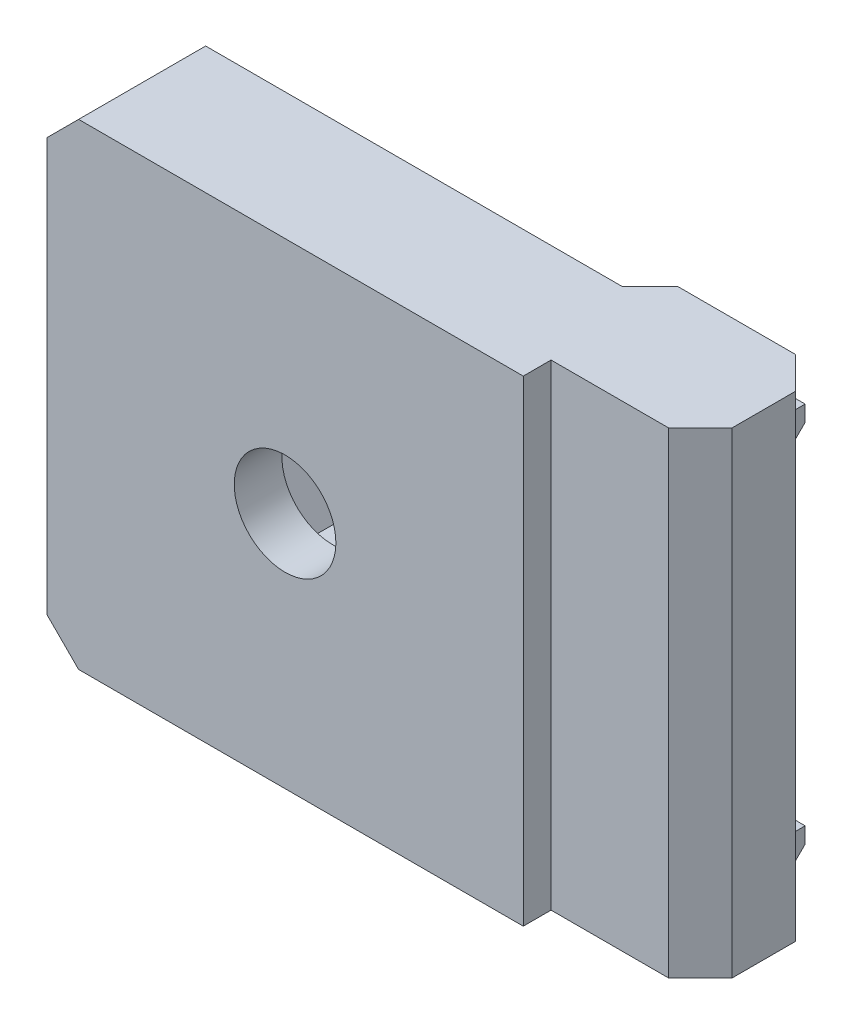
ISO-10303-21;
HEADER;
FILE_DESCRIPTION(('STEP AP214'),'2;1');
FILE_NAME('part.step','',(''),(''),'','','');
FILE_SCHEMA(('AUTOMOTIVE_DESIGN { 1 0 10303 214 1 1 1 1 }'));
ENDSEC;
DATA;
#1=APPLICATION_CONTEXT('core data for automotive mechanical design processes');
#2=APPLICATION_PROTOCOL_DEFINITION('international standard','automotive_design',2000,#1);
#3=PRODUCT_CONTEXT('',#1,'mechanical');
#4=PRODUCT('Part','Part','',(#3));
#5=PRODUCT_RELATED_PRODUCT_CATEGORY('part','',(#4));
#6=PRODUCT_DEFINITION_FORMATION('','',#4);
#7=PRODUCT_DEFINITION_CONTEXT('part definition',#1,'design');
#8=PRODUCT_DEFINITION('design','',#6,#7);
#9=PRODUCT_DEFINITION_SHAPE('','',#8);
#10=(LENGTH_UNIT() NAMED_UNIT(*) SI_UNIT(.MILLI.,.METRE.));
#11=(NAMED_UNIT(*) PLANE_ANGLE_UNIT() SI_UNIT($,.RADIAN.));
#12=(NAMED_UNIT(*) SI_UNIT($,.STERADIAN.) SOLID_ANGLE_UNIT());
#13=UNCERTAINTY_MEASURE_WITH_UNIT(LENGTH_MEASURE(1.E-05),#10,'distance_accuracy_value','');
#14=(GEOMETRIC_REPRESENTATION_CONTEXT(3) GLOBAL_UNCERTAINTY_ASSIGNED_CONTEXT((#13)) GLOBAL_UNIT_ASSIGNED_CONTEXT((#10,
#11,#12)) REPRESENTATION_CONTEXT('',''));
#15=CARTESIAN_POINT('',(0.,0.,0.));
#16=DIRECTION('',(0.,0.,1.));
#17=DIRECTION('',(1.,0.,0.));
#18=AXIS2_PLACEMENT_3D('',#15,#16,#17);
#19=CARTESIAN_POINT('',(0.,15.,-9.75));
#20=DIRECTION('',(0.,0.,1.));
#21=DIRECTION('',(1.,0.,0.));
#22=AXIS2_PLACEMENT_3D('',#19,#20,#21);
#23=PLANE('',#22);
#24=DIRECTION('',(-1.,0.,0.));
#25=VECTOR('',#24,1.);
#26=CARTESIAN_POINT('',(7.4,-12.6,-9.75));
#27=LINE('',#26,#25);
#28=CARTESIAN_POINT('',(7.4,-12.6,-9.75));
#29=VERTEX_POINT('',#28);
#30=CARTESIAN_POINT('',(0.,-12.6,-9.75));
#31=VERTEX_POINT('',#30);
#32=EDGE_CURVE('E224',#29,#31,#27,.T.);
#33=ORIENTED_EDGE('',*,*,#32,.F.);
#34=DIRECTION('',(0.,-1.,0.));
#35=VECTOR('',#34,1.);
#36=CARTESIAN_POINT('',(7.4,15.,-9.75));
#37=LINE('',#36,#35);
#38=CARTESIAN_POINT('',(7.4,-15.,-9.75));
#39=VERTEX_POINT('',#38);
#40=EDGE_CURVE('E210',#29,#39,#37,.T.);
#41=ORIENTED_EDGE('',*,*,#40,.T.);
#42=DIRECTION('',(-1.,0.,0.));
#43=VECTOR('',#42,1.);
#44=CARTESIAN_POINT('',(0.,-15.,-9.75));
#45=LINE('',#44,#43);
#46=CARTESIAN_POINT('',(0.,-15.,-9.75));
#47=VERTEX_POINT('',#46);
#48=EDGE_CURVE('E353',#39,#47,#45,.T.);
#49=ORIENTED_EDGE('',*,*,#48,.T.);
#50=DIRECTION('',(0.,-1.,0.));
#51=VECTOR('',#50,1.);
#52=CARTESIAN_POINT('',(0.,15.,-9.75));
#53=LINE('',#52,#51);
#54=EDGE_CURVE('E51',#31,#47,#53,.T.);
#55=ORIENTED_EDGE('',*,*,#54,.F.);
#56=EDGE_LOOP('',(#33,#41,#49,#55));
#57=FACE_BOUND('',#56,.T.);
#58=ADVANCED_FACE('F35',(#57),#23,.F.);
#59=DIRECTION('',(-1.,0.,0.));
#60=VECTOR('',#59,1.);
#61=CARTESIAN_POINT('',(7.4,-11.,-9.75));
#62=LINE('',#61,#60);
#63=CARTESIAN_POINT('',(7.4,-11.,-9.75));
#64=VERTEX_POINT('',#63);
#65=CARTESIAN_POINT('',(0.,-11.,-9.75));
#66=VERTEX_POINT('',#65);
#67=EDGE_CURVE('E59',#64,#66,#62,.T.);
#68=ORIENTED_EDGE('',*,*,#67,.T.);
#69=CARTESIAN_POINT('',(0.,10.4,-9.75));
#70=VERTEX_POINT('',#69);
#71=EDGE_CURVE('E376',#70,#66,#53,.T.);
#72=ORIENTED_EDGE('',*,*,#71,.F.);
#73=DIRECTION('',(-1.,0.,0.));
#74=VECTOR('',#73,1.);
#75=CARTESIAN_POINT('',(7.4,10.4,-9.75));
#76=LINE('',#75,#74);
#77=CARTESIAN_POINT('',(7.4,10.4,-9.75));
#78=VERTEX_POINT('',#77);
#79=EDGE_CURVE('E287',#78,#70,#76,.T.);
#80=ORIENTED_EDGE('',*,*,#79,.F.);
#81=EDGE_CURVE('E219',#78,#64,#37,.T.);
#82=ORIENTED_EDGE('',*,*,#81,.T.);
#83=EDGE_LOOP('',(#68,#72,#80,#82));
#84=FACE_BOUND('',#83,.T.);
#85=ADVANCED_FACE('F494',(#84),#23,.F.);
#86=CARTESIAN_POINT('',(0.,15.,-1.75));
#87=DIRECTION('',(-1.,0.,0.));
#88=DIRECTION('',(0.,0.,1.));
#89=AXIS2_PLACEMENT_3D('',#86,#87,#88);
#90=PLANE('',#89);
#91=DIRECTION('',(0.,0.,-1.));
#92=VECTOR('',#91,1.);
#93=CARTESIAN_POINT('',(0.,-15.,-1.75));
#94=LINE('',#93,#92);
#95=CARTESIAN_POINT('',(0.,-15.,0.));
#96=VERTEX_POINT('',#95);
#97=CARTESIAN_POINT('',(0.,-15.,-1.75));
#98=VERTEX_POINT('',#97);
#99=EDGE_CURVE('E324',#96,#98,#94,.T.);
#100=ORIENTED_EDGE('',*,*,#99,.T.);
#101=DIRECTION('',(0.,-1.,0.));
#102=VECTOR('',#101,1.);
#103=CARTESIAN_POINT('',(0.,15.,-1.75));
#104=LINE('',#103,#102);
#105=CARTESIAN_POINT('',(0.,15.,-1.75));
#106=VERTEX_POINT('',#105);
#107=EDGE_CURVE('E375',#106,#98,#104,.T.);
#108=ORIENTED_EDGE('',*,*,#107,.F.);
#109=DIRECTION('',(0.,0.,-1.));
#110=VECTOR('',#109,1.);
#111=CARTESIAN_POINT('',(0.,15.,-1.75));
#112=LINE('',#111,#110);
#113=CARTESIAN_POINT('',(0.,15.,0.));
#114=VERTEX_POINT('',#113);
#115=EDGE_CURVE('E325',#114,#106,#112,.T.);
#116=ORIENTED_EDGE('',*,*,#115,.F.);
#117=DIRECTION('',(0.,-1.,0.));
#118=VECTOR('',#117,1.);
#119=CARTESIAN_POINT('',(0.,15.,0.));
#120=LINE('',#119,#118);
#121=EDGE_CURVE('E344',#114,#96,#120,.T.);
#122=ORIENTED_EDGE('',*,*,#121,.T.);
#123=EDGE_LOOP('',(#100,#108,#116,#122));
#124=FACE_BOUND('',#123,.T.);
#125=ADVANCED_FACE('F458',(#124),#90,.F.);
#126=CARTESIAN_POINT('',(9.4,15.,-1.75));
#127=DIRECTION('',(0.,0.,-1.));
#128=DIRECTION('',(-1.,0.,0.));
#129=AXIS2_PLACEMENT_3D('',#126,#127,#128);
#130=PLANE('',#129);
#131=DIRECTION('',(1.,0.,0.));
#132=VECTOR('',#131,1.);
#133=CARTESIAN_POINT('',(9.4,-15.,-1.75));
#134=LINE('',#133,#132);
#135=CARTESIAN_POINT('',(7.39999999999999,-15.,-1.75));
#136=VERTEX_POINT('',#135);
#137=EDGE_CURVE('E347',#98,#136,#134,.T.);
#138=ORIENTED_EDGE('',*,*,#137,.T.);
#139=DIRECTION('',(0.,1.,0.));
#140=VECTOR('',#139,1.);
#141=CARTESIAN_POINT('',(7.39999999999999,15.,-1.75));
#142=LINE('',#141,#140);
#143=CARTESIAN_POINT('',(7.39999999999999,15.,-1.75));
#144=VERTEX_POINT('',#143);
#145=EDGE_CURVE('E409',#136,#144,#142,.T.);
#146=ORIENTED_EDGE('',*,*,#145,.T.);
#147=DIRECTION('',(1.,0.,0.));
#148=VECTOR('',#147,1.);
#149=CARTESIAN_POINT('',(9.4,15.,-1.75));
#150=LINE('',#149,#148);
#151=EDGE_CURVE('E328',#106,#144,#150,.T.);
#152=ORIENTED_EDGE('',*,*,#151,.F.);
#153=ORIENTED_EDGE('',*,*,#107,.T.);
#154=EDGE_LOOP('',(#138,#146,#152,#153));
#155=FACE_BOUND('',#154,.T.);
#156=ADVANCED_FACE('F508',(#155),#130,.F.);
#157=CARTESIAN_POINT('',(9.4,15.,-9.75));
#158=DIRECTION('',(-1.,0.,0.));
#159=DIRECTION('',(0.,0.,1.));
#160=AXIS2_PLACEMENT_3D('',#157,#158,#159);
#161=PLANE('',#160);
#162=DIRECTION('',(0.,0.,-1.));
#163=VECTOR('',#162,1.);
#164=CARTESIAN_POINT('',(9.4,15.,-9.75));
#165=LINE('',#164,#163);
#166=CARTESIAN_POINT('',(9.4,15.,-3.75000000000001));
#167=VERTEX_POINT('',#166);
#168=CARTESIAN_POINT('',(9.4,15.,-7.74999999999999));
#169=VERTEX_POINT('',#168);
#170=EDGE_CURVE('E332',#167,#169,#165,.T.);
#171=ORIENTED_EDGE('',*,*,#170,.F.);
#172=DIRECTION('',(0.,-1.,0.));
#173=VECTOR('',#172,1.);
#174=CARTESIAN_POINT('',(9.4,15.,-3.75000000000001));
#175=LINE('',#174,#173);
#176=CARTESIAN_POINT('',(9.4,-15.,-3.75000000000001));
#177=VERTEX_POINT('',#176);
#178=EDGE_CURVE('E401',#167,#177,#175,.T.);
#179=ORIENTED_EDGE('',*,*,#178,.T.);
#180=DIRECTION('',(0.,0.,-1.));
#181=VECTOR('',#180,1.);
#182=CARTESIAN_POINT('',(9.4,-15.,-9.75));
#183=LINE('',#182,#181);
#184=CARTESIAN_POINT('',(9.4,-15.,-7.74999999999999));
#185=VERTEX_POINT('',#184);
#186=EDGE_CURVE('E350',#177,#185,#183,.T.);
#187=ORIENTED_EDGE('',*,*,#186,.T.);
#188=DIRECTION('',(0.,1.,0.));
#189=VECTOR('',#188,1.);
#190=CARTESIAN_POINT('',(9.4,15.,-7.74999999999999));
#191=LINE('',#190,#189);
#192=EDGE_CURVE('E399',#185,#169,#191,.T.);
#193=ORIENTED_EDGE('',*,*,#192,.T.);
#194=EDGE_LOOP('',(#171,#179,#187,#193));
#195=FACE_BOUND('',#194,.T.);
#196=ADVANCED_FACE('F468',(#195),#161,.F.);
#197=CARTESIAN_POINT('',(7.4,15.,-9.75));
#198=VERTEX_POINT('',#197);
#199=CARTESIAN_POINT('',(7.4,12.,-9.75));
#200=VERTEX_POINT('',#199);
#201=EDGE_CURVE('E222',#198,#200,#37,.T.);
#202=ORIENTED_EDGE('',*,*,#201,.T.);
#203=DIRECTION('',(-1.,0.,0.));
#204=VECTOR('',#203,1.);
#205=CARTESIAN_POINT('',(7.4,12.,-9.75));
#206=LINE('',#205,#204);
#207=CARTESIAN_POINT('',(0.,12.,-9.75));
#208=VERTEX_POINT('',#207);
#209=EDGE_CURVE('E270',#200,#208,#206,.T.);
#210=ORIENTED_EDGE('',*,*,#209,.T.);
#211=CARTESIAN_POINT('',(0.,15.,-9.75));
#212=VERTEX_POINT('',#211);
#213=EDGE_CURVE('E372',#212,#208,#53,.T.);
#214=ORIENTED_EDGE('',*,*,#213,.F.);
#215=DIRECTION('',(-1.,0.,0.));
#216=VECTOR('',#215,1.);
#217=CARTESIAN_POINT('',(0.,15.,-9.75));
#218=LINE('',#217,#216);
#219=EDGE_CURVE('E335',#198,#212,#218,.T.);
#220=ORIENTED_EDGE('',*,*,#219,.F.);
#221=EDGE_LOOP('',(#202,#210,#214,#220));
#222=FACE_BOUND('',#221,.T.);
#223=ADVANCED_FACE('F496',(#222),#23,.F.);
#224=CARTESIAN_POINT('',(-1.75,15.,-8.));
#225=DIRECTION('',(0.707106781186549,0.,0.707106781186546));
#226=DIRECTION('',(0.707106781186546,0.,-0.707106781186549));
#227=AXIS2_PLACEMENT_3D('',#224,#225,#226);
#228=PLANE('',#227);
#229=DIRECTION('',(-0.707106781186546,0.,0.707106781186549));
#230=VECTOR('',#229,1.);
#231=CARTESIAN_POINT('',(-1.75,-15.,-8.));
#232=LINE('',#231,#230);
#233=CARTESIAN_POINT('',(-1.75,-15.,-8.));
#234=VERTEX_POINT('',#233);
#235=EDGE_CURVE('E355',#47,#234,#232,.T.);
#236=ORIENTED_EDGE('',*,*,#235,.T.);
#237=DIRECTION('',(0.,-1.,0.));
#238=VECTOR('',#237,1.);
#239=CARTESIAN_POINT('',(-1.75,15.,-8.));
#240=LINE('',#239,#238);
#241=CARTESIAN_POINT('',(-1.75,15.,-8.));
#242=VERTEX_POINT('',#241);
#243=EDGE_CURVE('E369',#242,#234,#240,.T.);
#244=ORIENTED_EDGE('',*,*,#243,.F.);
#245=DIRECTION('',(-0.707106781186546,0.,0.707106781186549));
#246=VECTOR('',#245,1.);
#247=CARTESIAN_POINT('',(-1.75,15.,-8.));
#248=LINE('',#247,#246);
#249=EDGE_CURVE('E337',#212,#242,#248,.T.);
#250=ORIENTED_EDGE('',*,*,#249,.F.);
#251=ORIENTED_EDGE('',*,*,#213,.T.);
#252=DIRECTION('',(0.,-1.,0.));
#253=VECTOR('',#252,1.);
#254=CARTESIAN_POINT('',(0.,10.4,-9.75));
#255=LINE('',#254,#253);
#256=EDGE_CURVE('E227',#208,#70,#255,.T.);
#257=ORIENTED_EDGE('',*,*,#256,.T.);
#258=ORIENTED_EDGE('',*,*,#71,.T.);
#259=DIRECTION('',(0.,-1.,0.));
#260=VECTOR('',#259,1.);
#261=CARTESIAN_POINT('',(0.,-12.6,-9.75));
#262=LINE('',#261,#260);
#263=EDGE_CURVE('E250',#66,#31,#262,.T.);
#264=ORIENTED_EDGE('',*,*,#263,.T.);
#265=ORIENTED_EDGE('',*,*,#54,.T.);
#266=EDGE_LOOP('',(#236,#244,#250,#251,#257,#258,#264,#265));
#267=FACE_BOUND('',#266,.T.);
#268=ADVANCED_FACE('F471',(#267),#228,.F.);
#269=CARTESIAN_POINT('',(-30.,15.,-8.));
#270=DIRECTION('',(0.,0.,1.));
#271=DIRECTION('',(1.,0.,0.));
#272=AXIS2_PLACEMENT_3D('',#269,#270,#271);
#273=PLANE('',#272);
#274=DIRECTION('',(1.,0.,0.));
#275=VECTOR('',#274,1.);
#276=CARTESIAN_POINT('',(-30.,-5.,-8.));
#277=LINE('',#276,#275);
#278=CARTESIAN_POINT('',(-17.8867513459481,-5.,-8.));
#279=VERTEX_POINT('',#278);
#280=CARTESIAN_POINT('',(-12.1132486540519,-5.00000000000001,-8.));
#281=VERTEX_POINT('',#280);
#282=EDGE_CURVE('E393',#279,#281,#277,.T.);
#283=ORIENTED_EDGE('',*,*,#282,.T.);
#284=DIRECTION('',(0.5,0.866025403784439,0.));
#285=VECTOR('',#284,1.);
#286=CARTESIAN_POINT('',(-7.92468245269451,2.25480947161672,-8.));
#287=LINE('',#286,#285);
#288=CARTESIAN_POINT('',(-9.22649730810374,0.,-8.));
#289=VERTEX_POINT('',#288);
#290=EDGE_CURVE('E396',#281,#289,#287,.T.);
#291=ORIENTED_EDGE('',*,*,#290,.T.);
#292=DIRECTION('',(-0.5,0.866025403784439,0.));
#293=VECTOR('',#292,1.);
#294=CARTESIAN_POINT('',(-20.9150635094611,20.2451905283833,-8.));
#295=LINE('',#294,#293);
#296=CARTESIAN_POINT('',(-12.1132486540519,5.,-8.));
#297=VERTEX_POINT('',#296);
#298=EDGE_CURVE('E379',#289,#297,#295,.T.);
#299=ORIENTED_EDGE('',*,*,#298,.T.);
#300=DIRECTION('',(-1.,0.,0.));
#301=VECTOR('',#300,1.);
#302=CARTESIAN_POINT('',(-30.,5.,-8.));
#303=LINE('',#302,#301);
#304=CARTESIAN_POINT('',(-17.8867513459481,5.,-8.));
#305=VERTEX_POINT('',#304);
#306=EDGE_CURVE('E384',#297,#305,#303,.T.);
#307=ORIENTED_EDGE('',*,*,#306,.T.);
#308=DIRECTION('',(-0.5,-0.866025403784439,0.));
#309=VECTOR('',#308,1.);
#310=CARTESIAN_POINT('',(-16.5849364905389,7.25480947161671,-8.));
#311=LINE('',#310,#309);
#312=CARTESIAN_POINT('',(-20.7735026918963,0.,-8.));
#313=VERTEX_POINT('',#312);
#314=EDGE_CURVE('E387',#305,#313,#311,.T.);
#315=ORIENTED_EDGE('',*,*,#314,.T.);
#316=DIRECTION('',(0.5,-0.866025403784439,0.));
#317=VECTOR('',#316,1.);
#318=CARTESIAN_POINT('',(-29.5753175473055,15.2451905283833,-8.));
#319=LINE('',#318,#317);
#320=EDGE_CURVE('E390',#313,#279,#319,.T.);
#321=ORIENTED_EDGE('',*,*,#320,.T.);
#322=EDGE_LOOP('',(#283,#291,#299,#307,#315,#321));
#323=FACE_BOUND('',#322,.T.);
#324=DIRECTION('',(-1.,0.,0.));
#325=VECTOR('',#324,1.);
#326=CARTESIAN_POINT('',(-30.,-15.,-8.));
#327=LINE('',#326,#325);
#328=CARTESIAN_POINT('',(-28.,-15.,-8.));
#329=VERTEX_POINT('',#328);
#330=EDGE_CURVE('E357',#234,#329,#327,.T.);
#331=ORIENTED_EDGE('',*,*,#330,.T.);
#332=DIRECTION('',(-0.707106781186548,0.707106781186548,0.));
#333=VECTOR('',#332,1.);
#334=CARTESIAN_POINT('',(-30.,-13.,-8.));
#335=LINE('',#334,#333);
#336=CARTESIAN_POINT('',(-30.,-13.,-8.));
#337=VERTEX_POINT('',#336);
#338=EDGE_CURVE('E11',#329,#337,#335,.T.);
#339=ORIENTED_EDGE('',*,*,#338,.T.);
#340=DIRECTION('',(0.,-1.,0.));
#341=VECTOR('',#340,1.);
#342=CARTESIAN_POINT('',(-30.,15.,-8.));
#343=LINE('',#342,#341);
#344=CARTESIAN_POINT('',(-30.,13.,-8.));
#345=VERTEX_POINT('',#344);
#346=EDGE_CURVE('E366',#345,#337,#343,.T.);
#347=ORIENTED_EDGE('',*,*,#346,.F.);
#348=DIRECTION('',(-0.707106781186548,-0.707106781186548,0.));
#349=VECTOR('',#348,1.);
#350=CARTESIAN_POINT('',(-28.,15.,-8.));
#351=LINE('',#350,#349);
#352=CARTESIAN_POINT('',(-28.,15.,-8.));
#353=VERTEX_POINT('',#352);
#354=EDGE_CURVE('E44',#345,#353,#351,.F.);
#355=ORIENTED_EDGE('',*,*,#354,.T.);
#356=DIRECTION('',(-1.,0.,0.));
#357=VECTOR('',#356,1.);
#358=CARTESIAN_POINT('',(-30.,15.,-8.));
#359=LINE('',#358,#357);
#360=EDGE_CURVE('E339',#242,#353,#359,.T.);
#361=ORIENTED_EDGE('',*,*,#360,.F.);
#362=ORIENTED_EDGE('',*,*,#243,.T.);
#363=EDGE_LOOP('',(#331,#339,#347,#355,#361,#362));
#364=FACE_BOUND('',#363,.T.);
#365=ADVANCED_FACE('F430',(#323,#364),#273,.F.);
#366=CARTESIAN_POINT('',(-30.,15.,0.));
#367=DIRECTION('',(1.,0.,0.));
#368=DIRECTION('',(0.,0.,-1.));
#369=AXIS2_PLACEMENT_3D('',#366,#367,#368);
#370=PLANE('',#369);
#371=ORIENTED_EDGE('',*,*,#346,.T.);
#372=DIRECTION('',(0.,0.,1.));
#373=VECTOR('',#372,1.);
#374=CARTESIAN_POINT('',(-30.,-13.,0.));
#375=LINE('',#374,#373);
#376=CARTESIAN_POINT('',(-30.,-13.,0.));
#377=VERTEX_POINT('',#376);
#378=EDGE_CURVE('E420',#337,#377,#375,.T.);
#379=ORIENTED_EDGE('',*,*,#378,.T.);
#380=DIRECTION('',(0.,-1.,0.));
#381=VECTOR('',#380,1.);
#382=CARTESIAN_POINT('',(-30.,15.,0.));
#383=LINE('',#382,#381);
#384=CARTESIAN_POINT('',(-30.,13.,0.));
#385=VERTEX_POINT('',#384);
#386=EDGE_CURVE('E363',#385,#377,#383,.T.);
#387=ORIENTED_EDGE('',*,*,#386,.F.);
#388=DIRECTION('',(0.,0.,-1.));
#389=VECTOR('',#388,1.);
#390=CARTESIAN_POINT('',(-30.,13.,0.));
#391=LINE('',#390,#389);
#392=EDGE_CURVE('E418',#385,#345,#391,.T.);
#393=ORIENTED_EDGE('',*,*,#392,.T.);
#394=EDGE_LOOP('',(#371,#379,#387,#393));
#395=FACE_BOUND('',#394,.T.);
#396=ADVANCED_FACE('F444',(#395),#370,.F.);
#397=CARTESIAN_POINT('',(0.,15.,0.));
#398=DIRECTION('',(0.,0.,-1.));
#399=DIRECTION('',(-1.,0.,0.));
#400=AXIS2_PLACEMENT_3D('',#397,#398,#399);
#401=PLANE('',#400);
#402=CARTESIAN_POINT('',(-15.,0.,0.));
#403=DIRECTION('',(0.,0.,1.));
#404=DIRECTION('',(1.,0.,0.));
#405=AXIS2_PLACEMENT_3D('',#402,#403,#404);
#406=CIRCLE('',#405,3.2);
#407=CARTESIAN_POINT('',(-11.8,0.,0.));
#408=VERTEX_POINT('',#407);
#409=EDGE_CURVE('E321',#408,#408,#406,.T.);
#410=ORIENTED_EDGE('',*,*,#409,.F.);
#411=EDGE_LOOP('',(#410));
#412=FACE_BOUND('',#411,.T.);
#413=ORIENTED_EDGE('',*,*,#386,.T.);
#414=DIRECTION('',(0.707106781186548,-0.707106781186548,0.));
#415=VECTOR('',#414,1.);
#416=CARTESIAN_POINT('',(-30.,-13.,0.));
#417=LINE('',#416,#415);
#418=CARTESIAN_POINT('',(-28.,-15.,0.));
#419=VERTEX_POINT('',#418);
#420=EDGE_CURVE('E425',#377,#419,#417,.T.);
#421=ORIENTED_EDGE('',*,*,#420,.T.);
#422=DIRECTION('',(1.,0.,0.));
#423=VECTOR('',#422,1.);
#424=CARTESIAN_POINT('',(0.,-15.,0.));
#425=LINE('',#424,#423);
#426=EDGE_CURVE('E329',#419,#96,#425,.T.);
#427=ORIENTED_EDGE('',*,*,#426,.T.);
#428=ORIENTED_EDGE('',*,*,#121,.F.);
#429=DIRECTION('',(1.,0.,0.));
#430=VECTOR('',#429,1.);
#431=CARTESIAN_POINT('',(0.,15.,0.));
#432=LINE('',#431,#430);
#433=CARTESIAN_POINT('',(-28.,15.,0.));
#434=VERTEX_POINT('',#433);
#435=EDGE_CURVE('E342',#434,#114,#432,.T.);
#436=ORIENTED_EDGE('',*,*,#435,.F.);
#437=DIRECTION('',(0.707106781186548,0.707106781186548,0.));
#438=VECTOR('',#437,1.);
#439=CARTESIAN_POINT('',(-28.,15.,0.));
#440=LINE('',#439,#438);
#441=EDGE_CURVE('E423',#434,#385,#440,.F.);
#442=ORIENTED_EDGE('',*,*,#441,.T.);
#443=EDGE_LOOP('',(#413,#421,#427,#428,#436,#442));
#444=FACE_BOUND('',#443,.T.);
#445=ADVANCED_FACE('F441',(#412,#444),#401,.F.);
#446=CARTESIAN_POINT('',(0.,15.,0.));
#447=DIRECTION('',(0.,-1.,0.));
#448=DIRECTION('',(0.,0.,-1.));
#449=AXIS2_PLACEMENT_3D('',#446,#447,#448);
#450=PLANE('',#449);
#451=ORIENTED_EDGE('',*,*,#151,.T.);
#452=DIRECTION('',(-0.707106781186549,0.,0.707106781186546));
#453=VECTOR('',#452,1.);
#454=CARTESIAN_POINT('',(9.4,15.,-3.75000000000001));
#455=LINE('',#454,#453);
#456=EDGE_CURVE('E220',#144,#167,#455,.F.);
#457=ORIENTED_EDGE('',*,*,#456,.T.);
#458=ORIENTED_EDGE('',*,*,#170,.T.);
#459=DIRECTION('',(0.707106781186546,0.,0.707106781186549));
#460=VECTOR('',#459,1.);
#461=CARTESIAN_POINT('',(7.4,15.,-9.75));
#462=LINE('',#461,#460);
#463=EDGE_CURVE('E414',#169,#198,#462,.F.);
#464=ORIENTED_EDGE('',*,*,#463,.T.);
#465=ORIENTED_EDGE('',*,*,#219,.T.);
#466=ORIENTED_EDGE('',*,*,#249,.T.);
#467=ORIENTED_EDGE('',*,*,#360,.T.);
#468=DIRECTION('',(0.,0.,1.));
#469=VECTOR('',#468,1.);
#470=CARTESIAN_POINT('',(-28.,15.,0.));
#471=LINE('',#470,#469);
#472=EDGE_CURVE('E411',#353,#434,#471,.T.);
#473=ORIENTED_EDGE('',*,*,#472,.T.);
#474=ORIENTED_EDGE('',*,*,#435,.T.);
#475=ORIENTED_EDGE('',*,*,#115,.T.);
#476=EDGE_LOOP('',(#451,#457,#458,#464,#465,#466,#467,#473,#474,#475));
#477=FACE_BOUND('',#476,.T.);
#478=ADVANCED_FACE('F435',(#477),#450,.F.);
#479=CARTESIAN_POINT('',(0.,-15.,0.));
#480=DIRECTION('',(0.,-1.,0.));
#481=DIRECTION('',(0.,0.,-1.));
#482=AXIS2_PLACEMENT_3D('',#479,#480,#481);
#483=PLANE('',#482);
#484=ORIENTED_EDGE('',*,*,#186,.F.);
#485=DIRECTION('',(0.707106781186549,0.,-0.707106781186546));
#486=VECTOR('',#485,1.);
#487=CARTESIAN_POINT('',(2.82499999999998,-15.,2.82499999999999));
#488=LINE('',#487,#486);
#489=EDGE_CURVE('E407',#177,#136,#488,.F.);
#490=ORIENTED_EDGE('',*,*,#489,.T.);
#491=ORIENTED_EDGE('',*,*,#137,.F.);
#492=ORIENTED_EDGE('',*,*,#99,.F.);
#493=ORIENTED_EDGE('',*,*,#426,.F.);
#494=DIRECTION('',(0.,0.,-1.));
#495=VECTOR('',#494,1.);
#496=CARTESIAN_POINT('',(-28.,-15.,-8.));
#497=LINE('',#496,#495);
#498=EDGE_CURVE('E404',#419,#329,#497,.T.);
#499=ORIENTED_EDGE('',*,*,#498,.T.);
#500=ORIENTED_EDGE('',*,*,#330,.F.);
#501=ORIENTED_EDGE('',*,*,#235,.F.);
#502=ORIENTED_EDGE('',*,*,#48,.F.);
#503=DIRECTION('',(-0.707106781186546,0.,-0.707106781186549));
#504=VECTOR('',#503,1.);
#505=CARTESIAN_POINT('',(8.57500000000001,-15.,-8.57499999999999));
#506=LINE('',#505,#504);
#507=EDGE_CURVE('E217',#39,#185,#506,.F.);
#508=ORIENTED_EDGE('',*,*,#507,.T.);
#509=EDGE_LOOP('',(#484,#490,#491,#492,#493,#499,#500,#501,#502,#508));
#510=FACE_BOUND('',#509,.T.);
#511=ADVANCED_FACE('F454',(#510),#483,.T.);
#512=CARTESIAN_POINT('',(-15.,0.,-9.75));
#513=DIRECTION('',(0.,0.,1.));
#514=DIRECTION('',(1.,0.,0.));
#515=AXIS2_PLACEMENT_3D('',#512,#513,#514);
#516=CYLINDRICAL_SURFACE('',#515,3.2);
#517=CARTESIAN_POINT('',(-15.,0.,-3.));
#518=DIRECTION('',(0.,0.,1.));
#519=DIRECTION('',(1.,0.,0.));
#520=AXIS2_PLACEMENT_3D('',#517,#518,#519);
#521=CIRCLE('',#520,3.2);
#522=CARTESIAN_POINT('',(-11.8,0.,-3.));
#523=VERTEX_POINT('',#522);
#524=EDGE_CURVE('E311',#523,#523,#521,.F.);
#525=ORIENTED_EDGE('',*,*,#524,.T.);
#526=EDGE_LOOP('',(#525));
#527=FACE_BOUND('',#526,.T.);
#528=ORIENTED_EDGE('',*,*,#409,.T.);
#529=EDGE_LOOP('',(#528));
#530=FACE_BOUND('',#529,.T.);
#531=ADVANCED_FACE('F569',(#527,#530),#516,.F.);
#532=CARTESIAN_POINT('',(-12.1132486540519,-5.00000000000001,-9.75));
#533=DIRECTION('',(0.866025403784439,-0.5,0.));
#534=DIRECTION('',(0.5,0.866025403784439,0.));
#535=AXIS2_PLACEMENT_3D('',#532,#533,#534);
#536=PLANE('',#535);
#537=DIRECTION('',(0.,0.,1.));
#538=VECTOR('',#537,1.);
#539=CARTESIAN_POINT('',(-12.1132486540519,-5.00000000000001,-9.75));
#540=LINE('',#539,#538);
#541=CARTESIAN_POINT('',(-12.1132486540519,-5.00000000000001,-3.));
#542=VERTEX_POINT('',#541);
#543=EDGE_CURVE('E309',#281,#542,#540,.T.);
#544=ORIENTED_EDGE('',*,*,#543,.T.);
#545=DIRECTION('',(0.5,0.866025403784439,0.));
#546=VECTOR('',#545,1.);
#547=CARTESIAN_POINT('',(-12.1132486540519,-5.00000000000001,-3.));
#548=LINE('',#547,#546);
#549=CARTESIAN_POINT('',(-9.22649730810374,0.,-3.));
#550=VERTEX_POINT('',#549);
#551=EDGE_CURVE('E290',#542,#550,#548,.T.);
#552=ORIENTED_EDGE('',*,*,#551,.T.);
#553=DIRECTION('',(0.,0.,1.));
#554=VECTOR('',#553,1.);
#555=CARTESIAN_POINT('',(-9.22649730810374,0.,-9.75));
#556=LINE('',#555,#554);
#557=EDGE_CURVE('E308',#289,#550,#556,.T.);
#558=ORIENTED_EDGE('',*,*,#557,.F.);
#559=ORIENTED_EDGE('',*,*,#290,.F.);
#560=EDGE_LOOP('',(#544,#552,#558,#559));
#561=FACE_BOUND('',#560,.T.);
#562=ADVANCED_FACE('F551',(#561),#536,.F.);
#563=CARTESIAN_POINT('',(-17.8867513459481,-5.,-9.75));
#564=DIRECTION('',(0.,-1.,0.));
#565=DIRECTION('',(1.,0.,0.));
#566=AXIS2_PLACEMENT_3D('',#563,#564,#565);
#567=PLANE('',#566);
#568=DIRECTION('',(0.,0.,1.));
#569=VECTOR('',#568,1.);
#570=CARTESIAN_POINT('',(-17.8867513459481,-5.,-9.75));
#571=LINE('',#570,#569);
#572=CARTESIAN_POINT('',(-17.8867513459481,-5.,-3.));
#573=VERTEX_POINT('',#572);
#574=EDGE_CURVE('E312',#279,#573,#571,.T.);
#575=ORIENTED_EDGE('',*,*,#574,.T.);
#576=DIRECTION('',(1.,0.,0.));
#577=VECTOR('',#576,1.);
#578=CARTESIAN_POINT('',(-17.8867513459481,-5.,-3.));
#579=LINE('',#578,#577);
#580=EDGE_CURVE('E305',#573,#542,#579,.T.);
#581=ORIENTED_EDGE('',*,*,#580,.T.);
#582=ORIENTED_EDGE('',*,*,#543,.F.);
#583=ORIENTED_EDGE('',*,*,#282,.F.);
#584=EDGE_LOOP('',(#575,#581,#582,#583));
#585=FACE_BOUND('',#584,.T.);
#586=ADVANCED_FACE('F547',(#585),#567,.F.);
#587=CARTESIAN_POINT('',(-20.7735026918963,0.,-9.75));
#588=DIRECTION('',(-0.866025403784439,-0.5,0.));
#589=DIRECTION('',(0.5,-0.866025403784439,0.));
#590=AXIS2_PLACEMENT_3D('',#587,#588,#589);
#591=PLANE('',#590);
#592=DIRECTION('',(0.,0.,1.));
#593=VECTOR('',#592,1.);
#594=CARTESIAN_POINT('',(-20.7735026918963,0.,-9.75));
#595=LINE('',#594,#593);
#596=CARTESIAN_POINT('',(-20.7735026918963,0.,-3.));
#597=VERTEX_POINT('',#596);
#598=EDGE_CURVE('E314',#313,#597,#595,.T.);
#599=ORIENTED_EDGE('',*,*,#598,.T.);
#600=DIRECTION('',(0.5,-0.866025403784438,0.));
#601=VECTOR('',#600,1.);
#602=CARTESIAN_POINT('',(-20.7735026918963,0.,-3.));
#603=LINE('',#602,#601);
#604=EDGE_CURVE('E302',#597,#573,#603,.T.);
#605=ORIENTED_EDGE('',*,*,#604,.T.);
#606=ORIENTED_EDGE('',*,*,#574,.F.);
#607=ORIENTED_EDGE('',*,*,#320,.F.);
#608=EDGE_LOOP('',(#599,#605,#606,#607));
#609=FACE_BOUND('',#608,.T.);
#610=ADVANCED_FACE('F550',(#609),#591,.F.);
#611=CARTESIAN_POINT('',(-17.8867513459481,5.,-9.75));
#612=DIRECTION('',(-0.866025403784439,0.5,0.));
#613=DIRECTION('',(-0.5,-0.866025403784439,0.));
#614=AXIS2_PLACEMENT_3D('',#611,#612,#613);
#615=PLANE('',#614);
#616=DIRECTION('',(0.,0.,1.));
#617=VECTOR('',#616,1.);
#618=CARTESIAN_POINT('',(-17.8867513459481,5.,-9.75));
#619=LINE('',#618,#617);
#620=CARTESIAN_POINT('',(-17.8867513459481,5.,-3.));
#621=VERTEX_POINT('',#620);
#622=EDGE_CURVE('E316',#305,#621,#619,.T.);
#623=ORIENTED_EDGE('',*,*,#622,.T.);
#624=DIRECTION('',(-0.5,-0.866025403784439,0.));
#625=VECTOR('',#624,1.);
#626=CARTESIAN_POINT('',(-17.8867513459481,5.,-3.));
#627=LINE('',#626,#625);
#628=EDGE_CURVE('E299',#621,#597,#627,.T.);
#629=ORIENTED_EDGE('',*,*,#628,.T.);
#630=ORIENTED_EDGE('',*,*,#598,.F.);
#631=ORIENTED_EDGE('',*,*,#314,.F.);
#632=EDGE_LOOP('',(#623,#629,#630,#631));
#633=FACE_BOUND('',#632,.T.);
#634=ADVANCED_FACE('F555',(#633),#615,.F.);
#635=CARTESIAN_POINT('',(-12.1132486540519,5.,-9.75));
#636=DIRECTION('',(0.,1.,0.));
#637=DIRECTION('',(0.,0.,1.));
#638=AXIS2_PLACEMENT_3D('',#635,#636,#637);
#639=PLANE('',#638);
#640=DIRECTION('',(0.,0.,1.));
#641=VECTOR('',#640,1.);
#642=CARTESIAN_POINT('',(-12.1132486540519,5.,-9.75));
#643=LINE('',#642,#641);
#644=CARTESIAN_POINT('',(-12.1132486540519,5.,-3.));
#645=VERTEX_POINT('',#644);
#646=EDGE_CURVE('E318',#297,#645,#643,.T.);
#647=ORIENTED_EDGE('',*,*,#646,.T.);
#648=DIRECTION('',(-1.,0.,0.));
#649=VECTOR('',#648,1.);
#650=CARTESIAN_POINT('',(-12.1132486540519,5.,-3.));
#651=LINE('',#650,#649);
#652=EDGE_CURVE('E296',#645,#621,#651,.T.);
#653=ORIENTED_EDGE('',*,*,#652,.T.);
#654=ORIENTED_EDGE('',*,*,#622,.F.);
#655=ORIENTED_EDGE('',*,*,#306,.F.);
#656=EDGE_LOOP('',(#647,#653,#654,#655));
#657=FACE_BOUND('',#656,.T.);
#658=ADVANCED_FACE('F559',(#657),#639,.F.);
#659=CARTESIAN_POINT('',(-9.22649730810374,0.,-9.75));
#660=DIRECTION('',(0.866025403784439,0.5,0.));
#661=DIRECTION('',(-0.5,0.866025403784439,0.));
#662=AXIS2_PLACEMENT_3D('',#659,#660,#661);
#663=PLANE('',#662);
#664=ORIENTED_EDGE('',*,*,#557,.T.);
#665=DIRECTION('',(-0.5,0.866025403784439,0.));
#666=VECTOR('',#665,1.);
#667=CARTESIAN_POINT('',(-9.22649730810374,0.,-3.));
#668=LINE('',#667,#666);
#669=EDGE_CURVE('E293',#550,#645,#668,.T.);
#670=ORIENTED_EDGE('',*,*,#669,.T.);
#671=ORIENTED_EDGE('',*,*,#646,.F.);
#672=ORIENTED_EDGE('',*,*,#298,.F.);
#673=EDGE_LOOP('',(#664,#670,#671,#672));
#674=FACE_BOUND('',#673,.T.);
#675=ADVANCED_FACE('F545',(#674),#663,.F.);
#676=CARTESIAN_POINT('',(0.,0.,-3.));
#677=DIRECTION('',(0.,0.,1.));
#678=DIRECTION('',(1.,0.,0.));
#679=AXIS2_PLACEMENT_3D('',#676,#677,#678);
#680=PLANE('',#679);
#681=ORIENTED_EDGE('',*,*,#551,.F.);
#682=ORIENTED_EDGE('',*,*,#580,.F.);
#683=ORIENTED_EDGE('',*,*,#604,.F.);
#684=ORIENTED_EDGE('',*,*,#628,.F.);
#685=ORIENTED_EDGE('',*,*,#652,.F.);
#686=ORIENTED_EDGE('',*,*,#669,.F.);
#687=EDGE_LOOP('',(#681,#682,#683,#684,#685,#686));
#688=FACE_BOUND('',#687,.T.);
#689=ORIENTED_EDGE('',*,*,#524,.F.);
#690=EDGE_LOOP('',(#689));
#691=FACE_BOUND('',#690,.T.);
#692=ADVANCED_FACE('F542',(#688,#691),#680,.F.);
#693=CARTESIAN_POINT('',(9.4,15.,-3.75000000000001));
#694=DIRECTION('',(-0.707106781186546,0.,-0.707106781186549));
#695=DIRECTION('',(0.,-1.,0.));
#696=AXIS2_PLACEMENT_3D('',#693,#694,#695);
#697=PLANE('',#696);
#698=ORIENTED_EDGE('',*,*,#456,.F.);
#699=ORIENTED_EDGE('',*,*,#145,.F.);
#700=ORIENTED_EDGE('',*,*,#489,.F.);
#701=ORIENTED_EDGE('',*,*,#178,.F.);
#702=EDGE_LOOP('',(#698,#699,#700,#701));
#703=FACE_BOUND('',#702,.T.);
#704=ADVANCED_FACE('F466',(#703),#697,.F.);
#705=CARTESIAN_POINT('',(7.4,15.,-9.75));
#706=DIRECTION('',(-0.707106781186549,0.,0.707106781186546));
#707=DIRECTION('',(0.,-1.,0.));
#708=AXIS2_PLACEMENT_3D('',#705,#706,#707);
#709=PLANE('',#708);
#710=ORIENTED_EDGE('',*,*,#463,.F.);
#711=ORIENTED_EDGE('',*,*,#192,.F.);
#712=ORIENTED_EDGE('',*,*,#507,.F.);
#713=ORIENTED_EDGE('',*,*,#40,.F.);
#714=DIRECTION('',(0.,-1.,0.));
#715=VECTOR('',#714,1.);
#716=CARTESIAN_POINT('',(7.4,-12.6,-9.75));
#717=LINE('',#716,#715);
#718=EDGE_CURVE('E215',#64,#29,#717,.T.);
#719=ORIENTED_EDGE('',*,*,#718,.F.);
#720=ORIENTED_EDGE('',*,*,#81,.F.);
#721=DIRECTION('',(0.,-1.,0.));
#722=VECTOR('',#721,1.);
#723=CARTESIAN_POINT('',(7.4,10.4,-9.75));
#724=LINE('',#723,#722);
#725=EDGE_CURVE('E260',#200,#78,#724,.T.);
#726=ORIENTED_EDGE('',*,*,#725,.F.);
#727=ORIENTED_EDGE('',*,*,#201,.F.);
#728=EDGE_LOOP('',(#710,#711,#712,#713,#719,#720,#726,#727));
#729=FACE_BOUND('',#728,.T.);
#730=ADVANCED_FACE('F212',(#729),#709,.F.);
#731=CARTESIAN_POINT('',(-30.,-13.,0.));
#732=DIRECTION('',(-0.707106781186547,-0.707106781186547,0.));
#733=DIRECTION('',(0.,0.,-1.));
#734=AXIS2_PLACEMENT_3D('',#731,#732,#733);
#735=PLANE('',#734);
#736=ORIENTED_EDGE('',*,*,#338,.F.);
#737=ORIENTED_EDGE('',*,*,#498,.F.);
#738=ORIENTED_EDGE('',*,*,#420,.F.);
#739=ORIENTED_EDGE('',*,*,#378,.F.);
#740=EDGE_LOOP('',(#736,#737,#738,#739));
#741=FACE_BOUND('',#740,.T.);
#742=ADVANCED_FACE('F448',(#741),#735,.T.);
#743=CARTESIAN_POINT('',(-28.,15.,0.));
#744=DIRECTION('',(0.707106781186548,-0.707106781186548,0.));
#745=DIRECTION('',(0.,0.,1.));
#746=AXIS2_PLACEMENT_3D('',#743,#744,#745);
#747=PLANE('',#746);
#748=ORIENTED_EDGE('',*,*,#354,.F.);
#749=ORIENTED_EDGE('',*,*,#392,.F.);
#750=ORIENTED_EDGE('',*,*,#441,.F.);
#751=ORIENTED_EDGE('',*,*,#472,.F.);
#752=EDGE_LOOP('',(#748,#749,#750,#751));
#753=FACE_BOUND('',#752,.T.);
#754=ADVANCED_FACE('F38',(#753),#747,.F.);
#755=CARTESIAN_POINT('',(7.4,11.,-10.35));
#756=DIRECTION('',(0.,0.707106781186548,0.707106781186548));
#757=DIRECTION('',(0.,-0.707106781186548,0.707106781186548));
#758=AXIS2_PLACEMENT_3D('',#755,#756,#757);
#759=PLANE('',#758);
#760=DIRECTION('',(0.,0.707106781186547,-0.707106781186547));
#761=VECTOR('',#760,1.);
#762=CARTESIAN_POINT('',(0.,11.,-10.35));
#763=LINE('',#762,#761);
#764=CARTESIAN_POINT('',(0.,11.,-10.35));
#765=VERTEX_POINT('',#764);
#766=EDGE_CURVE('E273',#70,#765,#763,.T.);
#767=ORIENTED_EDGE('',*,*,#766,.T.);
#768=DIRECTION('',(-1.,0.,0.));
#769=VECTOR('',#768,1.);
#770=CARTESIAN_POINT('',(7.4,11.,-10.35));
#771=LINE('',#770,#769);
#772=CARTESIAN_POINT('',(7.4,11.,-10.35));
#773=VERTEX_POINT('',#772);
#774=EDGE_CURVE('E284',#773,#765,#771,.T.);
#775=ORIENTED_EDGE('',*,*,#774,.F.);
#776=DIRECTION('',(0.,0.707106781186547,-0.707106781186547));
#777=VECTOR('',#776,1.);
#778=CARTESIAN_POINT('',(7.4,11.,-10.35));
#779=LINE('',#778,#777);
#780=EDGE_CURVE('E263',#78,#773,#779,.T.);
#781=ORIENTED_EDGE('',*,*,#780,.F.);
#782=ORIENTED_EDGE('',*,*,#79,.T.);
#783=EDGE_LOOP('',(#767,#775,#781,#782));
#784=FACE_BOUND('',#783,.T.);
#785=ADVANCED_FACE('F519',(#784),#759,.F.);
#786=CARTESIAN_POINT('',(7.4,12.,-10.35));
#787=DIRECTION('',(0.,0.,1.));
#788=DIRECTION('',(1.,0.,0.));
#789=AXIS2_PLACEMENT_3D('',#786,#787,#788);
#790=PLANE('',#789);
#791=DIRECTION('',(0.,1.,0.));
#792=VECTOR('',#791,1.);
#793=CARTESIAN_POINT('',(0.,12.,-10.35));
#794=LINE('',#793,#792);
#795=CARTESIAN_POINT('',(0.,12.,-10.35));
#796=VERTEX_POINT('',#795);
#797=EDGE_CURVE('E275',#765,#796,#794,.T.);
#798=ORIENTED_EDGE('',*,*,#797,.T.);
#799=DIRECTION('',(-1.,0.,0.));
#800=VECTOR('',#799,1.);
#801=CARTESIAN_POINT('',(7.4,12.,-10.35));
#802=LINE('',#801,#800);
#803=CARTESIAN_POINT('',(7.4,12.,-10.35));
#804=VERTEX_POINT('',#803);
#805=EDGE_CURVE('E281',#804,#796,#802,.T.);
#806=ORIENTED_EDGE('',*,*,#805,.F.);
#807=DIRECTION('',(0.,1.,0.));
#808=VECTOR('',#807,1.);
#809=CARTESIAN_POINT('',(7.4,12.,-10.35));
#810=LINE('',#809,#808);
#811=EDGE_CURVE('E266',#773,#804,#810,.T.);
#812=ORIENTED_EDGE('',*,*,#811,.F.);
#813=ORIENTED_EDGE('',*,*,#774,.T.);
#814=EDGE_LOOP('',(#798,#806,#812,#813));
#815=FACE_BOUND('',#814,.T.);
#816=ADVANCED_FACE('F524',(#815),#790,.F.);
#817=CARTESIAN_POINT('',(7.4,12.,-9.75));
#818=DIRECTION('',(0.,-1.,0.));
#819=DIRECTION('',(0.,0.,-1.));
#820=AXIS2_PLACEMENT_3D('',#817,#818,#819);
#821=PLANE('',#820);
#822=DIRECTION('',(0.,0.,1.));
#823=VECTOR('',#822,1.);
#824=CARTESIAN_POINT('',(0.,12.,-9.75));
#825=LINE('',#824,#823);
#826=EDGE_CURVE('E264',#796,#208,#825,.T.);
#827=ORIENTED_EDGE('',*,*,#826,.T.);
#828=ORIENTED_EDGE('',*,*,#209,.F.);
#829=DIRECTION('',(0.,0.,1.));
#830=VECTOR('',#829,1.);
#831=CARTESIAN_POINT('',(7.4,12.,-9.75));
#832=LINE('',#831,#830);
#833=EDGE_CURVE('E268',#804,#200,#832,.T.);
#834=ORIENTED_EDGE('',*,*,#833,.F.);
#835=ORIENTED_EDGE('',*,*,#805,.T.);
#836=EDGE_LOOP('',(#827,#828,#834,#835));
#837=FACE_BOUND('',#836,.T.);
#838=ADVANCED_FACE('F527',(#837),#821,.F.);
#839=CARTESIAN_POINT('',(7.4,0.,0.));
#840=DIRECTION('',(-1.,0.,0.));
#841=DIRECTION('',(0.,0.,1.));
#842=AXIS2_PLACEMENT_3D('',#839,#840,#841);
#843=PLANE('',#842);
#844=ORIENTED_EDGE('',*,*,#725,.T.);
#845=ORIENTED_EDGE('',*,*,#780,.T.);
#846=ORIENTED_EDGE('',*,*,#811,.T.);
#847=ORIENTED_EDGE('',*,*,#833,.T.);
#848=EDGE_LOOP('',(#844,#845,#846,#847));
#849=FACE_BOUND('',#848,.T.);
#850=ADVANCED_FACE('F515',(#849),#843,.F.);
#851=CARTESIAN_POINT('',(0.,0.,0.));
#852=DIRECTION('',(-1.,0.,0.));
#853=DIRECTION('',(0.,0.,1.));
#854=AXIS2_PLACEMENT_3D('',#851,#852,#853);
#855=PLANE('',#854);
#856=ORIENTED_EDGE('',*,*,#256,.F.);
#857=ORIENTED_EDGE('',*,*,#826,.F.);
#858=ORIENTED_EDGE('',*,*,#797,.F.);
#859=ORIENTED_EDGE('',*,*,#766,.F.);
#860=EDGE_LOOP('',(#856,#857,#858,#859));
#861=FACE_BOUND('',#860,.T.);
#862=ADVANCED_FACE('F491',(#861),#855,.T.);
#863=CARTESIAN_POINT('',(7.4,-12.,-10.35));
#864=DIRECTION('',(0.,0.707106781186548,0.707106781186548));
#865=DIRECTION('',(0.,-0.707106781186548,0.707106781186548));
#866=AXIS2_PLACEMENT_3D('',#863,#864,#865);
#867=PLANE('',#866);
#868=DIRECTION('',(0.,0.707106781186547,-0.707106781186547));
#869=VECTOR('',#868,1.);
#870=CARTESIAN_POINT('',(0.,-12.,-10.35));
#871=LINE('',#870,#869);
#872=CARTESIAN_POINT('',(0.,-12.,-10.35));
#873=VERTEX_POINT('',#872);
#874=EDGE_CURVE('E252',#31,#873,#871,.T.);
#875=ORIENTED_EDGE('',*,*,#874,.T.);
#876=DIRECTION('',(-1.,0.,0.));
#877=VECTOR('',#876,1.);
#878=CARTESIAN_POINT('',(7.4,-12.,-10.35));
#879=LINE('',#878,#877);
#880=CARTESIAN_POINT('',(7.4,-12.,-10.35));
#881=VERTEX_POINT('',#880);
#882=EDGE_CURVE('E228',#881,#873,#879,.T.);
#883=ORIENTED_EDGE('',*,*,#882,.F.);
#884=DIRECTION('',(0.,0.707106781186547,-0.707106781186547));
#885=VECTOR('',#884,1.);
#886=CARTESIAN_POINT('',(7.4,-12.,-10.35));
#887=LINE('',#886,#885);
#888=EDGE_CURVE('E231',#29,#881,#887,.T.);
#889=ORIENTED_EDGE('',*,*,#888,.F.);
#890=ORIENTED_EDGE('',*,*,#32,.T.);
#891=EDGE_LOOP('',(#875,#883,#889,#890));
#892=FACE_BOUND('',#891,.T.);
#893=ADVANCED_FACE('F232',(#892),#867,.F.);
#894=CARTESIAN_POINT('',(7.4,-11.,-10.35));
#895=DIRECTION('',(0.,0.,1.));
#896=DIRECTION('',(1.,0.,0.));
#897=AXIS2_PLACEMENT_3D('',#894,#895,#896);
#898=PLANE('',#897);
#899=DIRECTION('',(0.,1.,0.));
#900=VECTOR('',#899,1.);
#901=CARTESIAN_POINT('',(0.,-11.,-10.35));
#902=LINE('',#901,#900);
#903=CARTESIAN_POINT('',(0.,-11.,-10.35));
#904=VERTEX_POINT('',#903);
#905=EDGE_CURVE('E245',#873,#904,#902,.T.);
#906=ORIENTED_EDGE('',*,*,#905,.T.);
#907=DIRECTION('',(-1.,0.,0.));
#908=VECTOR('',#907,1.);
#909=CARTESIAN_POINT('',(7.4,-11.,-10.35));
#910=LINE('',#909,#908);
#911=CARTESIAN_POINT('',(7.4,-11.,-10.35));
#912=VERTEX_POINT('',#911);
#913=EDGE_CURVE('E256',#912,#904,#910,.T.);
#914=ORIENTED_EDGE('',*,*,#913,.F.);
#915=DIRECTION('',(0.,1.,0.));
#916=VECTOR('',#915,1.);
#917=CARTESIAN_POINT('',(7.4,-11.,-10.35));
#918=LINE('',#917,#916);
#919=EDGE_CURVE('E236',#881,#912,#918,.T.);
#920=ORIENTED_EDGE('',*,*,#919,.F.);
#921=ORIENTED_EDGE('',*,*,#882,.T.);
#922=EDGE_LOOP('',(#906,#914,#920,#921));
#923=FACE_BOUND('',#922,.T.);
#924=ADVANCED_FACE('F483',(#923),#898,.F.);
#925=CARTESIAN_POINT('',(7.4,-11.,-9.75));
#926=DIRECTION('',(0.,-1.,0.));
#927=DIRECTION('',(0.,0.,-1.));
#928=AXIS2_PLACEMENT_3D('',#925,#926,#927);
#929=PLANE('',#928);
#930=DIRECTION('',(0.,0.,1.));
#931=VECTOR('',#930,1.);
#932=CARTESIAN_POINT('',(0.,-11.,-9.75));
#933=LINE('',#932,#931);
#934=EDGE_CURVE('E242',#904,#66,#933,.T.);
#935=ORIENTED_EDGE('',*,*,#934,.T.);
#936=ORIENTED_EDGE('',*,*,#67,.F.);
#937=DIRECTION('',(0.,0.,1.));
#938=VECTOR('',#937,1.);
#939=CARTESIAN_POINT('',(7.4,-11.,-9.75));
#940=LINE('',#939,#938);
#941=EDGE_CURVE('E241',#912,#64,#940,.T.);
#942=ORIENTED_EDGE('',*,*,#941,.F.);
#943=ORIENTED_EDGE('',*,*,#913,.T.);
#944=EDGE_LOOP('',(#935,#936,#942,#943));
#945=FACE_BOUND('',#944,.T.);
#946=ADVANCED_FACE('F477',(#945),#929,.F.);
#947=CARTESIAN_POINT('',(7.4,0.,0.));
#948=DIRECTION('',(-1.,0.,0.));
#949=DIRECTION('',(0.,0.,1.));
#950=AXIS2_PLACEMENT_3D('',#947,#948,#949);
#951=PLANE('',#950);
#952=ORIENTED_EDGE('',*,*,#718,.T.);
#953=ORIENTED_EDGE('',*,*,#888,.T.);
#954=ORIENTED_EDGE('',*,*,#919,.T.);
#955=ORIENTED_EDGE('',*,*,#941,.T.);
#956=EDGE_LOOP('',(#952,#953,#954,#955));
#957=FACE_BOUND('',#956,.T.);
#958=ADVANCED_FACE('F239',(#957),#951,.F.);
#959=CARTESIAN_POINT('',(0.,0.,0.));
#960=DIRECTION('',(-1.,0.,0.));
#961=DIRECTION('',(0.,0.,1.));
#962=AXIS2_PLACEMENT_3D('',#959,#960,#961);
#963=PLANE('',#962);
#964=ORIENTED_EDGE('',*,*,#263,.F.);
#965=ORIENTED_EDGE('',*,*,#934,.F.);
#966=ORIENTED_EDGE('',*,*,#905,.F.);
#967=ORIENTED_EDGE('',*,*,#874,.F.);
#968=EDGE_LOOP('',(#964,#965,#966,#967));
#969=FACE_BOUND('',#968,.T.);
#970=ADVANCED_FACE('F481',(#969),#963,.T.);
#971=CLOSED_SHELL('',(#58,#85,#125,#156,#196,#223,#268,#365,#396,#445,#478,#511,#531,#562,#586,
#610,#634,#658,#675,#692,#704,#730,#742,#754,#785,#816,#838,#850,#862,#893,#924,#946,#958,#970));
#972=MANIFOLD_SOLID_BREP('B2',#971);
#973=ADVANCED_BREP_SHAPE_REPRESENTATION('',(#18,#972),#14);
#974=SHAPE_DEFINITION_REPRESENTATION(#9,#973);
ENDSEC;
END-ISO-10303-21;
